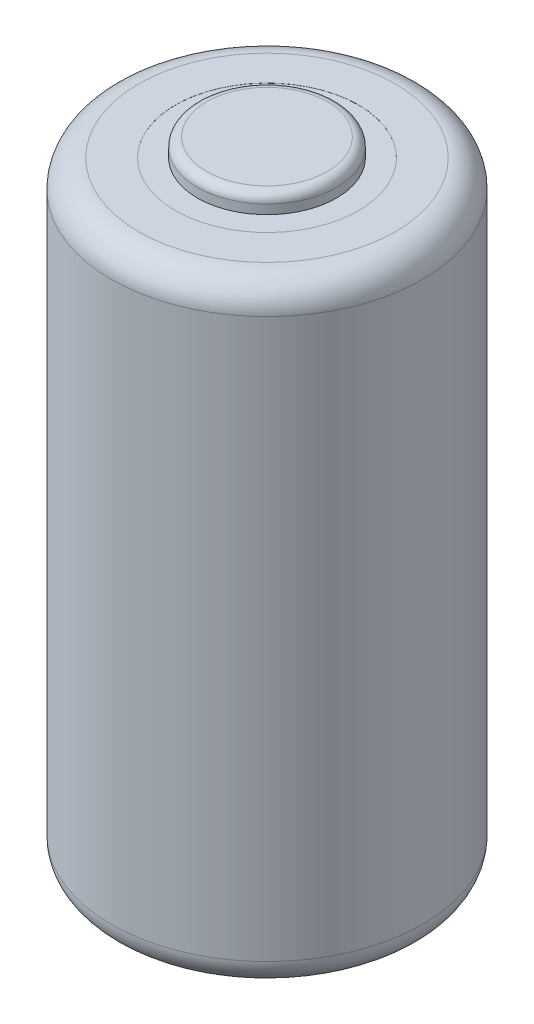
ISO-10303-21;
HEADER;
FILE_DESCRIPTION(('STEP AP214'),'2;1');
FILE_NAME('part.step','',(''),(''),'','','');
FILE_SCHEMA(('AUTOMOTIVE_DESIGN { 1 0 10303 214 1 1 1 1 }'));
ENDSEC;
DATA;
#1=APPLICATION_CONTEXT('core data for automotive mechanical design processes');
#2=APPLICATION_PROTOCOL_DEFINITION('international standard','automotive_design',2000,#1);
#3=PRODUCT_CONTEXT('',#1,'mechanical');
#4=PRODUCT('Part','Part','',(#3));
#5=PRODUCT_RELATED_PRODUCT_CATEGORY('part','',(#4));
#6=PRODUCT_DEFINITION_FORMATION('','',#4);
#7=PRODUCT_DEFINITION_CONTEXT('part definition',#1,'design');
#8=PRODUCT_DEFINITION('design','',#6,#7);
#9=PRODUCT_DEFINITION_SHAPE('','',#8);
#10=(LENGTH_UNIT() NAMED_UNIT(*) SI_UNIT(.MILLI.,.METRE.));
#11=(NAMED_UNIT(*) PLANE_ANGLE_UNIT() SI_UNIT($,.RADIAN.));
#12=(NAMED_UNIT(*) SI_UNIT($,.STERADIAN.) SOLID_ANGLE_UNIT());
#13=UNCERTAINTY_MEASURE_WITH_UNIT(LENGTH_MEASURE(1.E-05),#10,'distance_accuracy_value','');
#14=(GEOMETRIC_REPRESENTATION_CONTEXT(3) GLOBAL_UNCERTAINTY_ASSIGNED_CONTEXT((#13)) GLOBAL_UNIT_ASSIGNED_CONTEXT((#10,
#11,#12)) REPRESENTATION_CONTEXT('',''));
#15=CARTESIAN_POINT('',(0.,0.,0.));
#16=DIRECTION('',(0.,0.,1.));
#17=DIRECTION('',(1.,0.,0.));
#18=AXIS2_PLACEMENT_3D('',#15,#16,#17);
#19=CARTESIAN_POINT('',(0.,33.5,0.));
#20=DIRECTION('',(0.,1.,0.));
#21=DIRECTION('',(0.,0.,1.));
#22=AXIS2_PLACEMENT_3D('',#19,#20,#21);
#23=PLANE('',#22);
#24=CARTESIAN_POINT('',(0.,33.5,0.));
#25=DIRECTION('',(0.,1.,0.));
#26=DIRECTION('',(0.,0.,1.));
#27=AXIS2_PLACEMENT_3D('',#24,#25,#26);
#28=CIRCLE('',#27,5.);
#29=CARTESIAN_POINT('',(0.,33.5,5.));
#30=VERTEX_POINT('',#29);
#31=EDGE_CURVE('E60',#30,#30,#28,.T.);
#32=ORIENTED_EDGE('',*,*,#31,.F.);
#33=EDGE_LOOP('',(#32));
#34=FACE_BOUND('',#33,.T.);
#35=CARTESIAN_POINT('',(0.,33.5,0.));
#36=DIRECTION('',(0.,1.,0.));
#37=DIRECTION('',(0.,0.,1.));
#38=AXIS2_PLACEMENT_3D('',#35,#36,#37);
#39=CIRCLE('',#38,7.);
#40=CARTESIAN_POINT('',(0.,33.5,7.));
#41=VERTEX_POINT('',#40);
#42=EDGE_CURVE('E44',#41,#41,#39,.T.);
#43=ORIENTED_EDGE('',*,*,#42,.T.);
#44=EDGE_LOOP('',(#43));
#45=FACE_BOUND('',#44,.T.);
#46=ADVANCED_FACE('F33',(#34,#45),#23,.T.);
#47=CARTESIAN_POINT('',(0.,33.5,0.));
#48=DIRECTION('',(0.,-1.,0.));
#49=DIRECTION('',(0.,0.,-1.));
#50=AXIS2_PLACEMENT_3D('',#47,#48,#49);
#51=CYLINDRICAL_SURFACE('',#50,8.5);
#52=CARTESIAN_POINT('',(0.,1.5,0.));
#53=DIRECTION('',(0.,1.,0.));
#54=DIRECTION('',(0.,0.,1.));
#55=AXIS2_PLACEMENT_3D('',#52,#53,#54);
#56=CIRCLE('',#55,8.5);
#57=CARTESIAN_POINT('',(0.,1.5,8.5));
#58=VERTEX_POINT('',#57);
#59=EDGE_CURVE('E53',#58,#58,#56,.T.);
#60=ORIENTED_EDGE('',*,*,#59,.T.);
#61=EDGE_LOOP('',(#60));
#62=FACE_BOUND('',#61,.T.);
#63=CARTESIAN_POINT('',(0.,32.,0.));
#64=DIRECTION('',(0.,1.,0.));
#65=DIRECTION('',(0.,0.,1.));
#66=AXIS2_PLACEMENT_3D('',#63,#64,#65);
#67=CIRCLE('',#66,8.5);
#68=CARTESIAN_POINT('',(0.,32.,8.5));
#69=VERTEX_POINT('',#68);
#70=EDGE_CURVE('E56',#69,#69,#67,.F.);
#71=ORIENTED_EDGE('',*,*,#70,.T.);
#72=EDGE_LOOP('',(#71));
#73=FACE_BOUND('',#72,.T.);
#74=ADVANCED_FACE('F87',(#62,#73),#51,.T.);
#75=CARTESIAN_POINT('',(0.,0.,0.));
#76=DIRECTION('',(0.,1.,0.));
#77=DIRECTION('',(0.,0.,1.));
#78=AXIS2_PLACEMENT_3D('',#75,#76,#77);
#79=PLANE('',#78);
#80=CARTESIAN_POINT('',(0.,0.,0.));
#81=DIRECTION('',(0.,1.,0.));
#82=DIRECTION('',(0.,0.,1.));
#83=AXIS2_PLACEMENT_3D('',#80,#81,#82);
#84=CIRCLE('',#83,7.);
#85=CARTESIAN_POINT('',(0.,0.,7.));
#86=VERTEX_POINT('',#85);
#87=EDGE_CURVE('E48',#86,#86,#84,.F.);
#88=ORIENTED_EDGE('',*,*,#87,.T.);
#89=EDGE_LOOP('',(#88));
#90=FACE_BOUND('',#89,.T.);
#91=ADVANCED_FACE('F97',(#90),#79,.F.);
#92=CARTESIAN_POINT('',(0.,1.5,0.));
#93=DIRECTION('',(0.,1.,0.));
#94=DIRECTION('',(0.,0.,1.));
#95=AXIS2_PLACEMENT_3D('',#92,#93,#94);
#96=TOROIDAL_SURFACE('',#95,7.,1.5);
#97=ORIENTED_EDGE('',*,*,#87,.F.);
#98=EDGE_LOOP('',(#97));
#99=FACE_BOUND('',#98,.T.);
#100=ORIENTED_EDGE('',*,*,#59,.F.);
#101=EDGE_LOOP('',(#100));
#102=FACE_BOUND('',#101,.T.);
#103=ADVANCED_FACE('F92',(#99,#102),#96,.T.);
#104=CARTESIAN_POINT('',(0.,32.,0.));
#105=DIRECTION('',(0.,1.,0.));
#106=DIRECTION('',(0.,0.,1.));
#107=AXIS2_PLACEMENT_3D('',#104,#105,#106);
#108=TOROIDAL_SURFACE('',#107,7.,1.5);
#109=ORIENTED_EDGE('',*,*,#70,.F.);
#110=EDGE_LOOP('',(#109));
#111=FACE_BOUND('',#110,.T.);
#112=ORIENTED_EDGE('',*,*,#42,.F.);
#113=EDGE_LOOP('',(#112));
#114=FACE_BOUND('',#113,.T.);
#115=ADVANCED_FACE('F81',(#111,#114),#108,.T.);
#116=CARTESIAN_POINT('',(0.,33.495,0.));
#117=DIRECTION('',(0.,1.,0.));
#118=DIRECTION('',(0.,0.,1.));
#119=AXIS2_PLACEMENT_3D('',#116,#117,#118);
#120=CYLINDRICAL_SURFACE('',#119,5.);
#121=CARTESIAN_POINT('',(0.,33.495,0.));
#122=DIRECTION('',(0.,1.,0.));
#123=DIRECTION('',(0.,0.,1.));
#124=AXIS2_PLACEMENT_3D('',#121,#122,#123);
#125=CIRCLE('',#124,5.);
#126=CARTESIAN_POINT('',(0.,33.495,5.));
#127=VERTEX_POINT('',#126);
#128=EDGE_CURVE('E59',#127,#127,#125,.T.);
#129=ORIENTED_EDGE('',*,*,#128,.F.);
#130=EDGE_LOOP('',(#129));
#131=FACE_BOUND('',#130,.T.);
#132=ORIENTED_EDGE('',*,*,#31,.T.);
#133=EDGE_LOOP('',(#132));
#134=FACE_BOUND('',#133,.T.);
#135=ADVANCED_FACE('F75',(#131,#134),#120,.F.);
#136=CARTESIAN_POINT('',(0.,33.495,0.));
#137=DIRECTION('',(0.,1.,0.));
#138=DIRECTION('',(0.,0.,1.));
#139=AXIS2_PLACEMENT_3D('',#136,#137,#138);
#140=PLANE('',#139);
#141=CARTESIAN_POINT('',(0.,33.495,0.));
#142=DIRECTION('',(0.,1.,0.));
#143=DIRECTION('',(0.,0.,1.));
#144=AXIS2_PLACEMENT_3D('',#141,#142,#143);
#145=CIRCLE('',#144,3.7999885534321);
#146=CARTESIAN_POINT('',(0.,33.495,3.7999885534321));
#147=VERTEX_POINT('',#146);
#148=EDGE_CURVE('E63',#147,#147,#145,.T.);
#149=ORIENTED_EDGE('',*,*,#148,.F.);
#150=EDGE_LOOP('',(#149));
#151=FACE_BOUND('',#150,.T.);
#152=ORIENTED_EDGE('',*,*,#128,.T.);
#153=EDGE_LOOP('',(#152));
#154=FACE_BOUND('',#153,.T.);
#155=ADVANCED_FACE('F71',(#151,#154),#140,.T.);
#156=CARTESIAN_POINT('',(0.,34.5,0.));
#157=DIRECTION('',(0.,1.,0.));
#158=DIRECTION('',(0.,0.,1.));
#159=AXIS2_PLACEMENT_3D('',#156,#157,#158);
#160=PLANE('',#159);
#161=CARTESIAN_POINT('',(0.,34.5,0.));
#162=DIRECTION('',(0.,1.,0.));
#163=DIRECTION('',(0.,0.,1.));
#164=AXIS2_PLACEMENT_3D('',#161,#162,#163);
#165=CIRCLE('',#164,3.2999885534321);
#166=CARTESIAN_POINT('',(0.,34.5,3.2999885534321));
#167=VERTEX_POINT('',#166);
#168=EDGE_CURVE('E40',#167,#167,#165,.T.);
#169=ORIENTED_EDGE('',*,*,#168,.T.);
#170=EDGE_LOOP('',(#169));
#171=FACE_BOUND('',#170,.T.);
#172=ADVANCED_FACE('F74',(#171),#160,.T.);
#173=CARTESIAN_POINT('',(0.,34.,0.));
#174=DIRECTION('',(0.,1.,0.));
#175=DIRECTION('',(0.,0.,1.));
#176=AXIS2_PLACEMENT_3D('',#173,#174,#175);
#177=TOROIDAL_SURFACE('',#176,3.2999885534321,0.5);
#178=CARTESIAN_POINT('',(0.,34.,0.));
#179=DIRECTION('',(0.,1.,0.));
#180=DIRECTION('',(0.,0.,1.));
#181=AXIS2_PLACEMENT_3D('',#178,#179,#180);
#182=CIRCLE('',#181,3.7999885534321);
#183=CARTESIAN_POINT('',(0.,34.,3.7999885534321));
#184=VERTEX_POINT('',#183);
#185=EDGE_CURVE('E10',#184,#184,#182,.F.);
#186=ORIENTED_EDGE('',*,*,#185,.F.);
#187=EDGE_LOOP('',(#186));
#188=FACE_BOUND('',#187,.T.);
#189=ORIENTED_EDGE('',*,*,#168,.F.);
#190=EDGE_LOOP('',(#189));
#191=FACE_BOUND('',#190,.T.);
#192=ADVANCED_FACE('F35',(#188,#191),#177,.T.);
#193=CARTESIAN_POINT('',(0.,34.5,0.));
#194=DIRECTION('',(0.,-1.,0.));
#195=DIRECTION('',(0.,0.,-1.));
#196=AXIS2_PLACEMENT_3D('',#193,#194,#195);
#197=CYLINDRICAL_SURFACE('',#196,3.7999885534321);
#198=ORIENTED_EDGE('',*,*,#185,.T.);
#199=EDGE_LOOP('',(#198));
#200=FACE_BOUND('',#199,.T.);
#201=ORIENTED_EDGE('',*,*,#148,.T.);
#202=EDGE_LOOP('',(#201));
#203=FACE_BOUND('',#202,.T.);
#204=ADVANCED_FACE('F69',(#200,#203),#197,.T.);
#205=CLOSED_SHELL('',(#46,#74,#91,#103,#115,#135,#155,#172,#192,#204));
#206=MANIFOLD_SOLID_BREP('B2',#205);
#207=ADVANCED_BREP_SHAPE_REPRESENTATION('',(#18,#206),#14);
#208=SHAPE_DEFINITION_REPRESENTATION(#9,#207);
ENDSEC;
END-ISO-10303-21;
